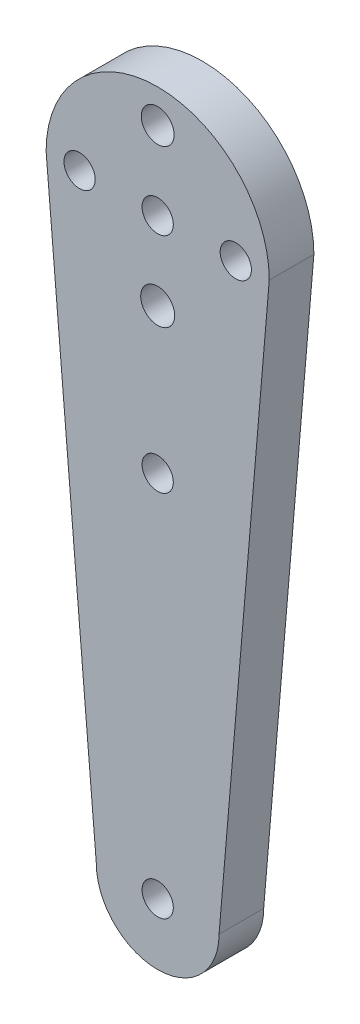
ISO-10303-21;
HEADER;
FILE_DESCRIPTION(('STEP AP214'),'2;1');
FILE_NAME('part.step','',(''),(''),'','','');
FILE_SCHEMA(('AUTOMOTIVE_DESIGN { 1 0 10303 214 1 1 1 1 }'));
ENDSEC;
DATA;
#1=APPLICATION_CONTEXT('core data for automotive mechanical design processes');
#2=APPLICATION_PROTOCOL_DEFINITION('international standard','automotive_design',2000,#1);
#3=PRODUCT_CONTEXT('',#1,'mechanical');
#4=PRODUCT('Part','Part','',(#3));
#5=PRODUCT_RELATED_PRODUCT_CATEGORY('part','',(#4));
#6=PRODUCT_DEFINITION_FORMATION('','',#4);
#7=PRODUCT_DEFINITION_CONTEXT('part definition',#1,'design');
#8=PRODUCT_DEFINITION('design','',#6,#7);
#9=PRODUCT_DEFINITION_SHAPE('','',#8);
#10=(LENGTH_UNIT() NAMED_UNIT(*) SI_UNIT(.MILLI.,.METRE.));
#11=(NAMED_UNIT(*) PLANE_ANGLE_UNIT() SI_UNIT($,.RADIAN.));
#12=(NAMED_UNIT(*) SI_UNIT($,.STERADIAN.) SOLID_ANGLE_UNIT());
#13=UNCERTAINTY_MEASURE_WITH_UNIT(LENGTH_MEASURE(1.E-05),#10,'distance_accuracy_value','');
#14=(GEOMETRIC_REPRESENTATION_CONTEXT(3) GLOBAL_UNCERTAINTY_ASSIGNED_CONTEXT((#13)) GLOBAL_UNIT_ASSIGNED_CONTEXT((#10,
#11,#12)) REPRESENTATION_CONTEXT('',''));
#15=CARTESIAN_POINT('',(0.,0.,0.));
#16=DIRECTION('',(0.,0.,1.));
#17=DIRECTION('',(1.,0.,0.));
#18=AXIS2_PLACEMENT_3D('',#15,#16,#17);
#19=CARTESIAN_POINT('',(-5.50068845938136,-8.00668270422256,4.));
#20=DIRECTION('',(0.,0.,1.));
#21=DIRECTION('',(1.,0.,0.));
#22=AXIS2_PLACEMENT_3D('',#19,#20,#21);
#23=PLANE('',#22);
#24=CARTESIAN_POINT('',(-5.50068845938136,25.0160917207258,4.));
#25=DIRECTION('',(0.,0.,1.));
#26=DIRECTION('',(1.,0.,0.));
#27=AXIS2_PLACEMENT_3D('',#24,#25,#26);
#28=CIRCLE('',#27,1.4);
#29=CARTESIAN_POINT('',(-4.10068845938136,25.0160917207258,4.));
#30=VERTEX_POINT('',#29);
#31=EDGE_CURVE('E294',#30,#30,#28,.T.);
#32=ORIENTED_EDGE('',*,*,#31,.F.);
#33=EDGE_LOOP('',(#32));
#34=FACE_BOUND('',#33,.T.);
#35=CARTESIAN_POINT('',(-5.50068845938136,38.0160917207258,4.));
#36=DIRECTION('',(0.,0.,1.));
#37=DIRECTION('',(1.,0.,0.));
#38=AXIS2_PLACEMENT_3D('',#35,#36,#37);
#39=CIRCLE('',#38,1.52167041353647);
#40=CARTESIAN_POINT('',(-3.97901804584488,38.0160917207258,4.));
#41=VERTEX_POINT('',#40);
#42=EDGE_CURVE('E117',#41,#41,#39,.T.);
#43=ORIENTED_EDGE('',*,*,#42,.F.);
#44=EDGE_LOOP('',(#43));
#45=FACE_BOUND('',#44,.T.);
#46=CARTESIAN_POINT('',(-5.50068845938136,52.0160917207258,4.));
#47=DIRECTION('',(0.,0.,1.));
#48=DIRECTION('',(1.,0.,0.));
#49=AXIS2_PLACEMENT_3D('',#46,#47,#48);
#50=CIRCLE('',#49,1.47258427116433);
#51=CARTESIAN_POINT('',(-4.02810418821703,52.0160917207258,4.));
#52=VERTEX_POINT('',#51);
#53=EDGE_CURVE('E287',#52,#52,#50,.T.);
#54=ORIENTED_EDGE('',*,*,#53,.F.);
#55=EDGE_LOOP('',(#54));
#56=FACE_BOUND('',#55,.T.);
#57=CARTESIAN_POINT('',(-5.50068845938136,45.0160917207258,4.));
#58=DIRECTION('',(0.,0.,1.));
#59=DIRECTION('',(1.,0.,0.));
#60=AXIS2_PLACEMENT_3D('',#57,#58,#59);
#61=CIRCLE('',#60,1.4);
#62=CARTESIAN_POINT('',(-4.10068845938136,45.0160917207258,4.));
#63=VERTEX_POINT('',#62);
#64=EDGE_CURVE('E132',#63,#63,#61,.T.);
#65=ORIENTED_EDGE('',*,*,#64,.F.);
#66=EDGE_LOOP('',(#65));
#67=FACE_BOUND('',#66,.T.);
#68=CARTESIAN_POINT('',(1.49931154061864,45.0160917207258,4.));
#69=DIRECTION('',(0.,0.,1.));
#70=DIRECTION('',(1.,0.,0.));
#71=AXIS2_PLACEMENT_3D('',#68,#69,#70);
#72=CIRCLE('',#71,1.4);
#73=CARTESIAN_POINT('',(2.89931154061864,45.0160917207258,4.));
#74=VERTEX_POINT('',#73);
#75=EDGE_CURVE('E108',#74,#74,#72,.T.);
#76=ORIENTED_EDGE('',*,*,#75,.F.);
#77=EDGE_LOOP('',(#76));
#78=FACE_BOUND('',#77,.T.);
#79=CARTESIAN_POINT('',(-5.50068845938136,-8.00668270422256,4.));
#80=DIRECTION('',(0.,0.,1.));
#81=DIRECTION('',(1.,0.,0.));
#82=AXIS2_PLACEMENT_3D('',#79,#80,#81);
#83=CIRCLE('',#82,5.5);
#84=CARTESIAN_POINT('',(-11.0006884593814,-8.00668270422256,4.));
#85=VERTEX_POINT('',#84);
#86=CARTESIAN_POINT('',(-0.000688459381358031,-8.00668270422263,4.));
#87=VERTEX_POINT('',#86);
#88=EDGE_CURVE('E92',#85,#87,#83,.T.);
#89=ORIENTED_EDGE('',*,*,#88,.T.);
#90=DIRECTION('',(0.0845651858039821,0.996417949130754,0.));
#91=VECTOR('',#90,1.);
#92=CARTESIAN_POINT('',(-0.000688459381358031,-8.00668270422263,4.));
#93=LINE('',#92,#91);
#94=CARTESIAN_POINT('',(4.49931154061864,45.0160917207258,4.));
#95=VERTEX_POINT('',#94);
#96=EDGE_CURVE('E87',#87,#95,#93,.T.);
#97=ORIENTED_EDGE('',*,*,#96,.T.);
#98=CARTESIAN_POINT('',(-5.50068845938136,45.0160917207258,4.));
#99=DIRECTION('',(0.,0.,1.));
#100=DIRECTION('',(1.,0.,0.));
#101=AXIS2_PLACEMENT_3D('',#98,#99,#100);
#102=CIRCLE('',#101,10.);
#103=CARTESIAN_POINT('',(-15.5006884593814,45.0160917207258,4.));
#104=VERTEX_POINT('',#103);
#105=EDGE_CURVE('E90',#95,#104,#102,.T.);
#106=ORIENTED_EDGE('',*,*,#105,.T.);
#107=DIRECTION('',(0.0845651858039822,-0.996417949130754,0.));
#108=VECTOR('',#107,1.);
#109=CARTESIAN_POINT('',(-15.5006884593814,45.0160917207258,4.));
#110=LINE('',#109,#108);
#111=EDGE_CURVE('E57',#104,#85,#110,.T.);
#112=ORIENTED_EDGE('',*,*,#111,.T.);
#113=EDGE_LOOP('',(#89,#97,#106,#112));
#114=FACE_BOUND('',#113,.T.);
#115=CARTESIAN_POINT('',(-5.50068845938136,-8.00668270422256,4.));
#116=DIRECTION('',(0.,0.,1.));
#117=DIRECTION('',(1.,0.,0.));
#118=AXIS2_PLACEMENT_3D('',#115,#116,#117);
#119=CIRCLE('',#118,1.4000000000003);
#120=CARTESIAN_POINT('',(-4.10068845938106,-8.00668270422256,4.));
#121=VERTEX_POINT('',#120);
#122=EDGE_CURVE('E138',#121,#121,#119,.T.);
#123=ORIENTED_EDGE('',*,*,#122,.F.);
#124=EDGE_LOOP('',(#123));
#125=FACE_BOUND('',#124,.T.);
#126=CARTESIAN_POINT('',(-12.5006884593814,45.0160917207258,4.));
#127=DIRECTION('',(0.,0.,1.));
#128=DIRECTION('',(-1.,0.,0.));
#129=AXIS2_PLACEMENT_3D('',#126,#127,#128);
#130=CIRCLE('',#129,1.4);
#131=CARTESIAN_POINT('',(-13.9006884593814,45.0160917207258,4.));
#132=VERTEX_POINT('',#131);
#133=EDGE_CURVE('E123',#132,#132,#130,.T.);
#134=ORIENTED_EDGE('',*,*,#133,.F.);
#135=EDGE_LOOP('',(#134));
#136=FACE_BOUND('',#135,.T.);
#137=ADVANCED_FACE('F38',(#34,#45,#56,#67,#78,#114,#125,#136),#23,.T.);
#138=CARTESIAN_POINT('',(-5.50068845938136,-8.00668270422256,0.));
#139=DIRECTION('',(0.,0.,1.));
#140=DIRECTION('',(1.,0.,0.));
#141=AXIS2_PLACEMENT_3D('',#138,#139,#140);
#142=PLANE('',#141);
#143=CARTESIAN_POINT('',(-5.50068845938136,25.0160917207258,0.));
#144=DIRECTION('',(0.,0.,1.));
#145=DIRECTION('',(1.,0.,0.));
#146=AXIS2_PLACEMENT_3D('',#143,#144,#145);
#147=CIRCLE('',#146,1.4);
#148=CARTESIAN_POINT('',(-4.10068845938136,25.0160917207258,0.));
#149=VERTEX_POINT('',#148);
#150=EDGE_CURVE('E42',#149,#149,#147,.T.);
#151=ORIENTED_EDGE('',*,*,#150,.T.);
#152=EDGE_LOOP('',(#151));
#153=FACE_BOUND('',#152,.T.);
#154=CARTESIAN_POINT('',(-5.50068845938136,38.0160917207258,0.));
#155=DIRECTION('',(0.,0.,1.));
#156=DIRECTION('',(1.,0.,0.));
#157=AXIS2_PLACEMENT_3D('',#154,#155,#156);
#158=CIRCLE('',#157,1.52167041353647);
#159=CARTESIAN_POINT('',(-3.97901804584488,38.0160917207258,0.));
#160=VERTEX_POINT('',#159);
#161=EDGE_CURVE('E116',#160,#160,#158,.T.);
#162=ORIENTED_EDGE('',*,*,#161,.T.);
#163=EDGE_LOOP('',(#162));
#164=FACE_BOUND('',#163,.T.);
#165=CARTESIAN_POINT('',(-5.50068845938136,52.0160917207258,0.));
#166=DIRECTION('',(0.,0.,1.));
#167=DIRECTION('',(1.,0.,0.));
#168=AXIS2_PLACEMENT_3D('',#165,#166,#167);
#169=CIRCLE('',#168,1.47258427116433);
#170=CARTESIAN_POINT('',(-4.02810418821703,52.0160917207258,0.));
#171=VERTEX_POINT('',#170);
#172=EDGE_CURVE('E114',#171,#171,#169,.T.);
#173=ORIENTED_EDGE('',*,*,#172,.T.);
#174=EDGE_LOOP('',(#173));
#175=FACE_BOUND('',#174,.T.);
#176=CARTESIAN_POINT('',(-5.50068845938136,-8.00668270422256,0.));
#177=DIRECTION('',(0.,0.,1.));
#178=DIRECTION('',(1.,0.,0.));
#179=AXIS2_PLACEMENT_3D('',#176,#177,#178);
#180=CIRCLE('',#179,5.5);
#181=CARTESIAN_POINT('',(-11.0006884593814,-8.00668270422256,0.));
#182=VERTEX_POINT('',#181);
#183=CARTESIAN_POINT('',(-0.000688459381358031,-8.00668270422263,0.));
#184=VERTEX_POINT('',#183);
#185=EDGE_CURVE('E105',#182,#184,#180,.T.);
#186=ORIENTED_EDGE('',*,*,#185,.F.);
#187=DIRECTION('',(0.0845651858039822,-0.996417949130754,0.));
#188=VECTOR('',#187,1.);
#189=CARTESIAN_POINT('',(-15.5006884593814,45.0160917207258,0.));
#190=LINE('',#189,#188);
#191=CARTESIAN_POINT('',(-15.5006884593814,45.0160917207258,0.));
#192=VERTEX_POINT('',#191);
#193=EDGE_CURVE('E80',#192,#182,#190,.T.);
#194=ORIENTED_EDGE('',*,*,#193,.F.);
#195=CARTESIAN_POINT('',(-5.50068845938136,45.0160917207258,0.));
#196=DIRECTION('',(0.,0.,1.));
#197=DIRECTION('',(1.,0.,0.));
#198=AXIS2_PLACEMENT_3D('',#195,#196,#197);
#199=CIRCLE('',#198,10.);
#200=CARTESIAN_POINT('',(4.49931154061864,45.0160917207258,0.));
#201=VERTEX_POINT('',#200);
#202=EDGE_CURVE('E74',#201,#192,#199,.T.);
#203=ORIENTED_EDGE('',*,*,#202,.F.);
#204=DIRECTION('',(0.0845651858039821,0.996417949130754,0.));
#205=VECTOR('',#204,1.);
#206=CARTESIAN_POINT('',(-0.000688459381358031,-8.00668270422263,0.));
#207=LINE('',#206,#205);
#208=EDGE_CURVE('E96',#184,#201,#207,.T.);
#209=ORIENTED_EDGE('',*,*,#208,.F.);
#210=EDGE_LOOP('',(#186,#194,#203,#209));
#211=FACE_BOUND('',#210,.T.);
#212=CARTESIAN_POINT('',(1.49931154061864,45.0160917207258,0.));
#213=DIRECTION('',(0.,0.,1.));
#214=DIRECTION('',(1.,0.,0.));
#215=AXIS2_PLACEMENT_3D('',#212,#213,#214);
#216=CIRCLE('',#215,1.4);
#217=CARTESIAN_POINT('',(2.89931154061864,45.0160917207258,0.));
#218=VERTEX_POINT('',#217);
#219=EDGE_CURVE('E141',#218,#218,#216,.T.);
#220=ORIENTED_EDGE('',*,*,#219,.T.);
#221=EDGE_LOOP('',(#220));
#222=FACE_BOUND('',#221,.T.);
#223=CARTESIAN_POINT('',(-5.50068845938136,-8.00668270422256,0.));
#224=DIRECTION('',(0.,0.,1.));
#225=DIRECTION('',(1.,0.,0.));
#226=AXIS2_PLACEMENT_3D('',#223,#224,#225);
#227=CIRCLE('',#226,1.4000000000003);
#228=CARTESIAN_POINT('',(-4.10068845938106,-8.00668270422256,0.));
#229=VERTEX_POINT('',#228);
#230=EDGE_CURVE('E135',#229,#229,#227,.T.);
#231=ORIENTED_EDGE('',*,*,#230,.T.);
#232=EDGE_LOOP('',(#231));
#233=FACE_BOUND('',#232,.T.);
#234=CARTESIAN_POINT('',(-5.50068845938136,45.0160917207258,0.));
#235=DIRECTION('',(0.,0.,1.));
#236=DIRECTION('',(1.,0.,0.));
#237=AXIS2_PLACEMENT_3D('',#234,#235,#236);
#238=CIRCLE('',#237,1.4);
#239=CARTESIAN_POINT('',(-4.10068845938136,45.0160917207258,0.));
#240=VERTEX_POINT('',#239);
#241=EDGE_CURVE('E128',#240,#240,#238,.T.);
#242=ORIENTED_EDGE('',*,*,#241,.T.);
#243=EDGE_LOOP('',(#242));
#244=FACE_BOUND('',#243,.T.);
#245=CARTESIAN_POINT('',(-12.5006884593814,45.0160917207258,0.));
#246=DIRECTION('',(0.,0.,1.));
#247=DIRECTION('',(-1.,0.,0.));
#248=AXIS2_PLACEMENT_3D('',#245,#246,#247);
#249=CIRCLE('',#248,1.4);
#250=CARTESIAN_POINT('',(-13.9006884593814,45.0160917207258,0.));
#251=VERTEX_POINT('',#250);
#252=EDGE_CURVE('E119',#251,#251,#249,.T.);
#253=ORIENTED_EDGE('',*,*,#252,.T.);
#254=EDGE_LOOP('',(#253));
#255=FACE_BOUND('',#254,.T.);
#256=ADVANCED_FACE('F149',(#153,#164,#175,#211,#222,#233,#244,#255),#142,.F.);
#257=CARTESIAN_POINT('',(-5.50068845938136,-8.00668270422256,4.));
#258=DIRECTION('',(0.,0.,-1.));
#259=DIRECTION('',(-1.,0.,0.));
#260=AXIS2_PLACEMENT_3D('',#257,#258,#259);
#261=CYLINDRICAL_SURFACE('',#260,5.5);
#262=ORIENTED_EDGE('',*,*,#185,.T.);
#263=DIRECTION('',(0.,0.,-1.));
#264=VECTOR('',#263,1.);
#265=CARTESIAN_POINT('',(-0.000688459381358031,-8.00668270422263,4.));
#266=LINE('',#265,#264);
#267=EDGE_CURVE('E11',#87,#184,#266,.T.);
#268=ORIENTED_EDGE('',*,*,#267,.F.);
#269=ORIENTED_EDGE('',*,*,#88,.F.);
#270=DIRECTION('',(0.,0.,-1.));
#271=VECTOR('',#270,1.);
#272=CARTESIAN_POINT('',(-11.0006884593814,-8.00668270422256,4.));
#273=LINE('',#272,#271);
#274=EDGE_CURVE('E101',#85,#182,#273,.T.);
#275=ORIENTED_EDGE('',*,*,#274,.T.);
#276=EDGE_LOOP('',(#262,#268,#269,#275));
#277=FACE_BOUND('',#276,.T.);
#278=ADVANCED_FACE('F40',(#277),#261,.T.);
#279=CARTESIAN_POINT('',(-0.000688459381358031,-8.00668270422263,4.));
#280=DIRECTION('',(-0.996417949130754,0.0845651858039821,0.));
#281=DIRECTION('',(-0.0845651858039821,-0.996417949130754,0.));
#282=AXIS2_PLACEMENT_3D('',#279,#280,#281);
#283=PLANE('',#282);
#284=ORIENTED_EDGE('',*,*,#208,.T.);
#285=DIRECTION('',(0.,0.,-1.));
#286=VECTOR('',#285,1.);
#287=CARTESIAN_POINT('',(4.49931154061864,45.0160917207258,4.));
#288=LINE('',#287,#286);
#289=EDGE_CURVE('E48',#95,#201,#288,.T.);
#290=ORIENTED_EDGE('',*,*,#289,.F.);
#291=ORIENTED_EDGE('',*,*,#96,.F.);
#292=ORIENTED_EDGE('',*,*,#267,.T.);
#293=EDGE_LOOP('',(#284,#290,#291,#292));
#294=FACE_BOUND('',#293,.T.);
#295=ADVANCED_FACE('F95',(#294),#283,.F.);
#296=CARTESIAN_POINT('',(-5.50068845938136,45.0160917207258,4.));
#297=DIRECTION('',(0.,0.,-1.));
#298=DIRECTION('',(-1.,0.,0.));
#299=AXIS2_PLACEMENT_3D('',#296,#297,#298);
#300=CYLINDRICAL_SURFACE('',#299,10.);
#301=ORIENTED_EDGE('',*,*,#202,.T.);
#302=DIRECTION('',(0.,0.,-1.));
#303=VECTOR('',#302,1.);
#304=CARTESIAN_POINT('',(-15.5006884593814,45.0160917207258,4.));
#305=LINE('',#304,#303);
#306=EDGE_CURVE('E97',#104,#192,#305,.T.);
#307=ORIENTED_EDGE('',*,*,#306,.F.);
#308=ORIENTED_EDGE('',*,*,#105,.F.);
#309=ORIENTED_EDGE('',*,*,#289,.T.);
#310=EDGE_LOOP('',(#301,#307,#308,#309));
#311=FACE_BOUND('',#310,.T.);
#312=ADVANCED_FACE('F99',(#311),#300,.T.);
#313=CARTESIAN_POINT('',(-15.5006884593814,45.0160917207258,4.));
#314=DIRECTION('',(0.996417949130754,0.0845651858039822,0.));
#315=DIRECTION('',(-0.0845651858039822,0.996417949130754,0.));
#316=AXIS2_PLACEMENT_3D('',#313,#314,#315);
#317=PLANE('',#316);
#318=ORIENTED_EDGE('',*,*,#193,.T.);
#319=ORIENTED_EDGE('',*,*,#274,.F.);
#320=ORIENTED_EDGE('',*,*,#111,.F.);
#321=ORIENTED_EDGE('',*,*,#306,.T.);
#322=EDGE_LOOP('',(#318,#319,#320,#321));
#323=FACE_BOUND('',#322,.T.);
#324=ADVANCED_FACE('F155',(#323),#317,.F.);
#325=CARTESIAN_POINT('',(1.49931154061864,45.0160917207258,4.));
#326=DIRECTION('',(0.,0.,-1.));
#327=DIRECTION('',(-1.,0.,0.));
#328=AXIS2_PLACEMENT_3D('',#325,#326,#327);
#329=CYLINDRICAL_SURFACE('',#328,1.4);
#330=ORIENTED_EDGE('',*,*,#75,.T.);
#331=EDGE_LOOP('',(#330));
#332=FACE_BOUND('',#331,.T.);
#333=ORIENTED_EDGE('',*,*,#219,.F.);
#334=EDGE_LOOP('',(#333));
#335=FACE_BOUND('',#334,.T.);
#336=ADVANCED_FACE('F152',(#332,#335),#329,.F.);
#337=CARTESIAN_POINT('',(-5.50068845938136,-8.00668270422256,4.));
#338=DIRECTION('',(0.,0.,-1.));
#339=DIRECTION('',(-1.,0.,0.));
#340=AXIS2_PLACEMENT_3D('',#337,#338,#339);
#341=CYLINDRICAL_SURFACE('',#340,1.4000000000003);
#342=ORIENTED_EDGE('',*,*,#122,.T.);
#343=EDGE_LOOP('',(#342));
#344=FACE_BOUND('',#343,.T.);
#345=ORIENTED_EDGE('',*,*,#230,.F.);
#346=EDGE_LOOP('',(#345));
#347=FACE_BOUND('',#346,.T.);
#348=ADVANCED_FACE('F154',(#344,#347),#341,.F.);
#349=CARTESIAN_POINT('',(-5.50068845938136,45.0160917207258,4.));
#350=DIRECTION('',(0.,0.,-1.));
#351=DIRECTION('',(-1.,0.,0.));
#352=AXIS2_PLACEMENT_3D('',#349,#350,#351);
#353=CYLINDRICAL_SURFACE('',#352,1.4);
#354=ORIENTED_EDGE('',*,*,#64,.T.);
#355=EDGE_LOOP('',(#354));
#356=FACE_BOUND('',#355,.T.);
#357=ORIENTED_EDGE('',*,*,#241,.F.);
#358=EDGE_LOOP('',(#357));
#359=FACE_BOUND('',#358,.T.);
#360=ADVANCED_FACE('F162',(#356,#359),#353,.F.);
#361=CARTESIAN_POINT('',(-12.5006884593814,45.0160917207258,4.));
#362=DIRECTION('',(0.,0.,-1.));
#363=DIRECTION('',(-1.,0.,0.));
#364=AXIS2_PLACEMENT_3D('',#361,#362,#363);
#365=CYLINDRICAL_SURFACE('',#364,1.4);
#366=ORIENTED_EDGE('',*,*,#133,.T.);
#367=EDGE_LOOP('',(#366));
#368=FACE_BOUND('',#367,.T.);
#369=ORIENTED_EDGE('',*,*,#252,.F.);
#370=EDGE_LOOP('',(#369));
#371=FACE_BOUND('',#370,.T.);
#372=ADVANCED_FACE('F220',(#368,#371),#365,.F.);
#373=CARTESIAN_POINT('',(-5.50068845938136,52.0160917207258,-6.));
#374=DIRECTION('',(0.,0.,1.));
#375=DIRECTION('',(1.,0.,0.));
#376=AXIS2_PLACEMENT_3D('',#373,#374,#375);
#377=CYLINDRICAL_SURFACE('',#376,1.47258427116433);
#378=ORIENTED_EDGE('',*,*,#53,.T.);
#379=EDGE_LOOP('',(#378));
#380=FACE_BOUND('',#379,.T.);
#381=ORIENTED_EDGE('',*,*,#172,.F.);
#382=EDGE_LOOP('',(#381));
#383=FACE_BOUND('',#382,.T.);
#384=ADVANCED_FACE('F213',(#380,#383),#377,.F.);
#385=CARTESIAN_POINT('',(-5.50068845938136,38.0160917207258,-6.));
#386=DIRECTION('',(0.,0.,1.));
#387=DIRECTION('',(1.,0.,0.));
#388=AXIS2_PLACEMENT_3D('',#385,#386,#387);
#389=CYLINDRICAL_SURFACE('',#388,1.52167041353647);
#390=ORIENTED_EDGE('',*,*,#42,.T.);
#391=EDGE_LOOP('',(#390));
#392=FACE_BOUND('',#391,.T.);
#393=ORIENTED_EDGE('',*,*,#161,.F.);
#394=EDGE_LOOP('',(#393));
#395=FACE_BOUND('',#394,.T.);
#396=ADVANCED_FACE('F203',(#392,#395),#389,.F.);
#397=CARTESIAN_POINT('',(-5.50068845938136,25.0160917207258,-6.));
#398=DIRECTION('',(0.,0.,1.));
#399=DIRECTION('',(1.,0.,0.));
#400=AXIS2_PLACEMENT_3D('',#397,#398,#399);
#401=CYLINDRICAL_SURFACE('',#400,1.4);
#402=ORIENTED_EDGE('',*,*,#31,.T.);
#403=EDGE_LOOP('',(#402));
#404=FACE_BOUND('',#403,.T.);
#405=ORIENTED_EDGE('',*,*,#150,.F.);
#406=EDGE_LOOP('',(#405));
#407=FACE_BOUND('',#406,.T.);
#408=ADVANCED_FACE('F199',(#404,#407),#401,.F.);
#409=CLOSED_SHELL('',(#137,#256,#278,#295,#312,#324,#336,#348,#360,#372,#384,#396,#408));
#410=MANIFOLD_SOLID_BREP('B2',#409);
#411=ADVANCED_BREP_SHAPE_REPRESENTATION('',(#18,#410),#14);
#412=SHAPE_DEFINITION_REPRESENTATION(#9,#411);
ENDSEC;
END-ISO-10303-21;
